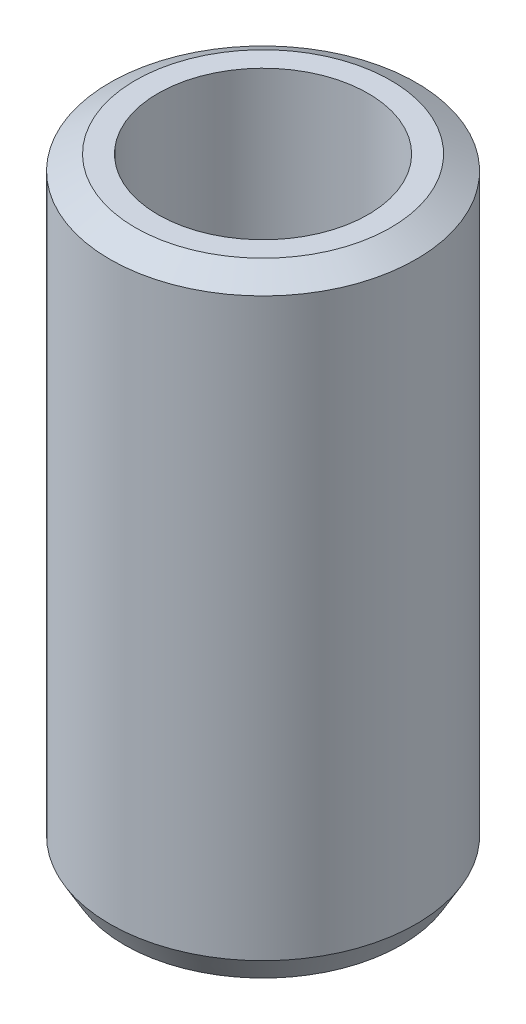
ISO-10303-21;
HEADER;
FILE_DESCRIPTION(('STEP AP214'),'2;1');
FILE_NAME('part.step','',(''),(''),'','','');
FILE_SCHEMA(('AUTOMOTIVE_DESIGN { 1 0 10303 214 1 1 1 1 }'));
ENDSEC;
DATA;
#1=APPLICATION_CONTEXT('core data for automotive mechanical design processes');
#2=APPLICATION_PROTOCOL_DEFINITION('international standard','automotive_design',2000,#1);
#3=PRODUCT_CONTEXT('',#1,'mechanical');
#4=PRODUCT('Part','Part','',(#3));
#5=PRODUCT_RELATED_PRODUCT_CATEGORY('part','',(#4));
#6=PRODUCT_DEFINITION_FORMATION('','',#4);
#7=PRODUCT_DEFINITION_CONTEXT('part definition',#1,'design');
#8=PRODUCT_DEFINITION('design','',#6,#7);
#9=PRODUCT_DEFINITION_SHAPE('','',#8);
#10=(LENGTH_UNIT() NAMED_UNIT(*) SI_UNIT(.MILLI.,.METRE.));
#11=(NAMED_UNIT(*) PLANE_ANGLE_UNIT() SI_UNIT($,.RADIAN.));
#12=(NAMED_UNIT(*) SI_UNIT($,.STERADIAN.) SOLID_ANGLE_UNIT());
#13=UNCERTAINTY_MEASURE_WITH_UNIT(LENGTH_MEASURE(1.E-05),#10,'distance_accuracy_value','');
#14=(GEOMETRIC_REPRESENTATION_CONTEXT(3) GLOBAL_UNCERTAINTY_ASSIGNED_CONTEXT((#13)) GLOBAL_UNIT_ASSIGNED_CONTEXT((#10,
#11,#12)) REPRESENTATION_CONTEXT('',''));
#15=CARTESIAN_POINT('',(0.,0.,0.));
#16=DIRECTION('',(0.,0.,1.));
#17=DIRECTION('',(1.,0.,0.));
#18=AXIS2_PLACEMENT_3D('',#15,#16,#17);
#19=CARTESIAN_POINT('',(0.,160.872735311425,0.));
#20=DIRECTION('',(0.,-1.,0.));
#21=DIRECTION('',(0.,0.,-1.));
#22=AXIS2_PLACEMENT_3D('',#19,#20,#21);
#23=CYLINDRICAL_SURFACE('',#22,40.);
#24=CARTESIAN_POINT('',(0.,157.034366172812,0.));
#25=DIRECTION('',(0.,1.,0.));
#26=DIRECTION('',(0.,0.,1.));
#27=AXIS2_PLACEMENT_3D('',#24,#25,#26);
#28=CIRCLE('',#27,40.);
#29=CARTESIAN_POINT('',(0.,157.034366172812,40.));
#30=VERTEX_POINT('',#29);
#31=EDGE_CURVE('E50',#30,#30,#28,.F.);
#32=ORIENTED_EDGE('',*,*,#31,.T.);
#33=EDGE_LOOP('',(#32));
#34=FACE_BOUND('',#33,.T.);
#35=CARTESIAN_POINT('',(0.,6.64825036628336,0.));
#36=DIRECTION('',(0.,1.,0.));
#37=DIRECTION('',(0.,0.,1.));
#38=AXIS2_PLACEMENT_3D('',#35,#36,#37);
#39=CIRCLE('',#38,40.);
#40=CARTESIAN_POINT('',(0.,6.64825036628336,40.));
#41=VERTEX_POINT('',#40);
#42=EDGE_CURVE('E51',#41,#41,#39,.T.);
#43=ORIENTED_EDGE('',*,*,#42,.T.);
#44=EDGE_LOOP('',(#43));
#45=FACE_BOUND('',#44,.T.);
#46=ADVANCED_FACE('F39',(#34,#45),#23,.T.);
#47=CARTESIAN_POINT('',(0.,160.872735311425,0.));
#48=DIRECTION('',(0.,1.,0.));
#49=DIRECTION('',(0.,0.,1.));
#50=AXIS2_PLACEMENT_3D('',#47,#48,#49);
#51=PLANE('',#50);
#52=CARTESIAN_POINT('',(0.,160.872735311425,0.));
#53=DIRECTION('',(0.,1.,0.));
#54=DIRECTION('',(0.,0.,1.));
#55=AXIS2_PLACEMENT_3D('',#52,#53,#54);
#56=CIRCLE('',#55,33.3517496337166);
#57=CARTESIAN_POINT('',(0.,160.872735311425,33.3517496337166));
#58=VERTEX_POINT('',#57);
#59=EDGE_CURVE('E54',#58,#58,#56,.T.);
#60=ORIENTED_EDGE('',*,*,#59,.T.);
#61=EDGE_LOOP('',(#60));
#62=FACE_BOUND('',#61,.T.);
#63=CARTESIAN_POINT('',(0.,160.872735311425,0.));
#64=DIRECTION('',(0.,1.,0.));
#65=DIRECTION('',(0.,0.,1.));
#66=AXIS2_PLACEMENT_3D('',#63,#64,#65);
#67=CIRCLE('',#66,27.4489670369146);
#68=CARTESIAN_POINT('',(0.,160.872735311425,27.4489670369146));
#69=VERTEX_POINT('',#68);
#70=EDGE_CURVE('E58',#69,#69,#67,.T.);
#71=ORIENTED_EDGE('',*,*,#70,.F.);
#72=EDGE_LOOP('',(#71));
#73=FACE_BOUND('',#72,.T.);
#74=ADVANCED_FACE('F69',(#62,#73),#51,.T.);
#75=CARTESIAN_POINT('',(0.,0.,0.));
#76=DIRECTION('',(0.,1.,0.));
#77=DIRECTION('',(0.,0.,1.));
#78=AXIS2_PLACEMENT_3D('',#75,#76,#77);
#79=PLANE('',#78);
#80=CARTESIAN_POINT('',(0.,0.,0.));
#81=DIRECTION('',(0.,1.,0.));
#82=DIRECTION('',(0.,0.,1.));
#83=AXIS2_PLACEMENT_3D('',#80,#81,#82);
#84=CIRCLE('',#83,36.1616308613862);
#85=CARTESIAN_POINT('',(0.,0.,36.1616308613862));
#86=VERTEX_POINT('',#85);
#87=EDGE_CURVE('E10',#86,#86,#84,.F.);
#88=ORIENTED_EDGE('',*,*,#87,.T.);
#89=EDGE_LOOP('',(#88));
#90=FACE_BOUND('',#89,.T.);
#91=CARTESIAN_POINT('',(0.,0.,0.));
#92=DIRECTION('',(0.,1.,0.));
#93=DIRECTION('',(0.,0.,1.));
#94=AXIS2_PLACEMENT_3D('',#91,#92,#93);
#95=CIRCLE('',#94,27.4489670369146);
#96=CARTESIAN_POINT('',(0.,0.,27.4489670369146));
#97=VERTEX_POINT('',#96);
#98=EDGE_CURVE('E63',#97,#97,#95,.T.);
#99=ORIENTED_EDGE('',*,*,#98,.T.);
#100=EDGE_LOOP('',(#99));
#101=FACE_BOUND('',#100,.T.);
#102=ADVANCED_FACE('F75',(#90,#101),#79,.F.);
#103=CARTESIAN_POINT('',(0.,160.872735311425,0.));
#104=DIRECTION('',(0.,-1.,0.));
#105=DIRECTION('',(0.,0.,-1.));
#106=AXIS2_PLACEMENT_3D('',#103,#104,#105);
#107=CYLINDRICAL_SURFACE('',#106,27.4489670369146);
#108=ORIENTED_EDGE('',*,*,#70,.T.);
#109=EDGE_LOOP('',(#108));
#110=FACE_BOUND('',#109,.T.);
#111=ORIENTED_EDGE('',*,*,#98,.F.);
#112=EDGE_LOOP('',(#111));
#113=FACE_BOUND('',#112,.T.);
#114=ADVANCED_FACE('F70',(#110,#113),#107,.F.);
#115=CARTESIAN_POINT('',(0.,160.872735311425,0.));
#116=DIRECTION('',(0.,-1.,0.));
#117=DIRECTION('',(0.,0.,-1.));
#118=AXIS2_PLACEMENT_3D('',#115,#116,#117);
#119=CONICAL_SURFACE('',#118,33.3517496337166,1.0471975511966);
#120=ORIENTED_EDGE('',*,*,#31,.F.);
#121=EDGE_LOOP('',(#120));
#122=FACE_BOUND('',#121,.T.);
#123=ORIENTED_EDGE('',*,*,#59,.F.);
#124=EDGE_LOOP('',(#123));
#125=FACE_BOUND('',#124,.T.);
#126=ADVANCED_FACE('F81',(#122,#125),#119,.T.);
#127=CARTESIAN_POINT('',(0.,6.64825036628336,0.));
#128=DIRECTION('',(0.,1.,0.));
#129=DIRECTION('',(0.,0.,1.));
#130=AXIS2_PLACEMENT_3D('',#127,#128,#129);
#131=CONICAL_SURFACE('',#130,40.,0.523598775598304);
#132=ORIENTED_EDGE('',*,*,#87,.F.);
#133=EDGE_LOOP('',(#132));
#134=FACE_BOUND('',#133,.T.);
#135=ORIENTED_EDGE('',*,*,#42,.F.);
#136=EDGE_LOOP('',(#135));
#137=FACE_BOUND('',#136,.T.);
#138=ADVANCED_FACE('F45',(#134,#137),#131,.T.);
#139=CLOSED_SHELL('',(#46,#74,#102,#114,#126,#138));
#140=MANIFOLD_SOLID_BREP('B2',#139);
#141=ADVANCED_BREP_SHAPE_REPRESENTATION('',(#18,#140),#14);
#142=SHAPE_DEFINITION_REPRESENTATION(#9,#141);
ENDSEC;
END-ISO-10303-21;
